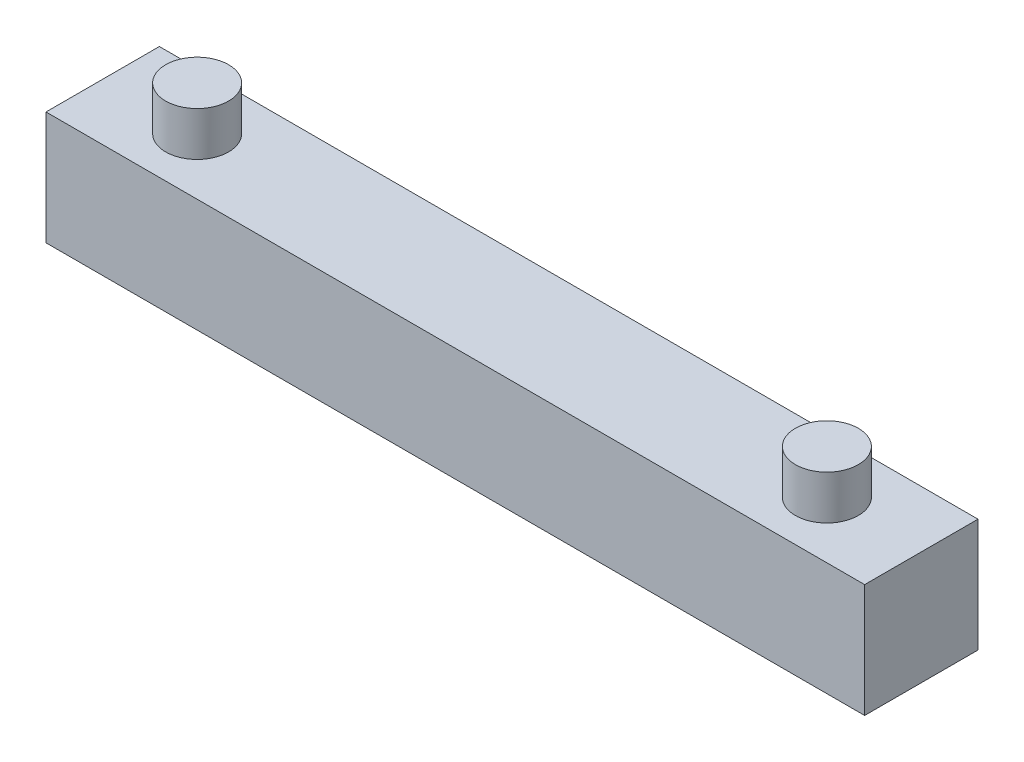
ISO-10303-21;
HEADER;
FILE_DESCRIPTION(('STEP AP214'),'2;1');
FILE_NAME('part.step','',(''),(''),'','','');
FILE_SCHEMA(('AUTOMOTIVE_DESIGN { 1 0 10303 214 1 1 1 1 }'));
ENDSEC;
DATA;
#1=APPLICATION_CONTEXT('core data for automotive mechanical design processes');
#2=APPLICATION_PROTOCOL_DEFINITION('international standard','automotive_design',2000,#1);
#3=PRODUCT_CONTEXT('',#1,'mechanical');
#4=PRODUCT('Part','Part','',(#3));
#5=PRODUCT_RELATED_PRODUCT_CATEGORY('part','',(#4));
#6=PRODUCT_DEFINITION_FORMATION('','',#4);
#7=PRODUCT_DEFINITION_CONTEXT('part definition',#1,'design');
#8=PRODUCT_DEFINITION('design','',#6,#7);
#9=PRODUCT_DEFINITION_SHAPE('','',#8);
#10=(LENGTH_UNIT() NAMED_UNIT(*) SI_UNIT(.MILLI.,.METRE.));
#11=(NAMED_UNIT(*) PLANE_ANGLE_UNIT() SI_UNIT($,.RADIAN.));
#12=(NAMED_UNIT(*) SI_UNIT($,.STERADIAN.) SOLID_ANGLE_UNIT());
#13=UNCERTAINTY_MEASURE_WITH_UNIT(LENGTH_MEASURE(1.E-05),#10,'distance_accuracy_value','');
#14=(GEOMETRIC_REPRESENTATION_CONTEXT(3) GLOBAL_UNCERTAINTY_ASSIGNED_CONTEXT((#13)) GLOBAL_UNIT_ASSIGNED_CONTEXT((#10,
#11,#12)) REPRESENTATION_CONTEXT('',''));
#15=CARTESIAN_POINT('',(0.,0.,0.));
#16=DIRECTION('',(0.,0.,1.));
#17=DIRECTION('',(1.,0.,0.));
#18=AXIS2_PLACEMENT_3D('',#15,#16,#17);
#19=CARTESIAN_POINT('',(0.,0.,9.));
#20=DIRECTION('',(1.,0.,0.));
#21=DIRECTION('',(0.,0.,-1.));
#22=AXIS2_PLACEMENT_3D('',#19,#20,#21);
#23=PLANE('',#22);
#24=DIRECTION('',(0.,-1.,0.));
#25=VECTOR('',#24,1.);
#26=CARTESIAN_POINT('',(0.,0.,0.));
#27=LINE('',#26,#25);
#28=CARTESIAN_POINT('',(0.,9.,0.));
#29=VERTEX_POINT('',#28);
#30=CARTESIAN_POINT('',(0.,0.,0.));
#31=VERTEX_POINT('',#30);
#32=EDGE_CURVE('E100',#29,#31,#27,.T.);
#33=ORIENTED_EDGE('',*,*,#32,.T.);
#34=DIRECTION('',(0.,0.,-1.));
#35=VECTOR('',#34,1.);
#36=CARTESIAN_POINT('',(0.,0.,9.));
#37=LINE('',#36,#35);
#38=CARTESIAN_POINT('',(0.,0.,9.));
#39=VERTEX_POINT('',#38);
#40=EDGE_CURVE('E91',#39,#31,#37,.T.);
#41=ORIENTED_EDGE('',*,*,#40,.F.);
#42=DIRECTION('',(0.,-1.,0.));
#43=VECTOR('',#42,1.);
#44=CARTESIAN_POINT('',(0.,0.,9.));
#45=LINE('',#44,#43);
#46=CARTESIAN_POINT('',(0.,9.,9.));
#47=VERTEX_POINT('',#46);
#48=EDGE_CURVE('E85',#47,#39,#45,.T.);
#49=ORIENTED_EDGE('',*,*,#48,.F.);
#50=DIRECTION('',(0.,0.,-1.));
#51=VECTOR('',#50,1.);
#52=CARTESIAN_POINT('',(0.,9.,9.));
#53=LINE('',#52,#51);
#54=EDGE_CURVE('E96',#47,#29,#53,.T.);
#55=ORIENTED_EDGE('',*,*,#54,.T.);
#56=EDGE_LOOP('',(#33,#41,#49,#55));
#57=FACE_BOUND('',#56,.T.);
#58=ADVANCED_FACE('F33',(#57),#23,.F.);
#59=CARTESIAN_POINT('',(0.,0.,9.));
#60=DIRECTION('',(0.,1.,0.));
#61=DIRECTION('',(0.,0.,1.));
#62=AXIS2_PLACEMENT_3D('',#59,#60,#61);
#63=PLANE('',#62);
#64=DIRECTION('',(1.,0.,0.));
#65=VECTOR('',#64,1.);
#66=CARTESIAN_POINT('',(0.,0.,0.));
#67=LINE('',#66,#65);
#68=CARTESIAN_POINT('',(65.,0.,0.));
#69=VERTEX_POINT('',#68);
#70=EDGE_CURVE('E90',#31,#69,#67,.T.);
#71=ORIENTED_EDGE('',*,*,#70,.T.);
#72=DIRECTION('',(0.,0.,-1.));
#73=VECTOR('',#72,1.);
#74=CARTESIAN_POINT('',(65.,0.,9.));
#75=LINE('',#74,#73);
#76=CARTESIAN_POINT('',(65.,0.,9.));
#77=VERTEX_POINT('',#76);
#78=EDGE_CURVE('E88',#77,#69,#75,.T.);
#79=ORIENTED_EDGE('',*,*,#78,.F.);
#80=DIRECTION('',(1.,0.,0.));
#81=VECTOR('',#80,1.);
#82=CARTESIAN_POINT('',(0.,0.,9.));
#83=LINE('',#82,#81);
#84=EDGE_CURVE('E80',#39,#77,#83,.T.);
#85=ORIENTED_EDGE('',*,*,#84,.F.);
#86=ORIENTED_EDGE('',*,*,#40,.T.);
#87=EDGE_LOOP('',(#71,#79,#85,#86));
#88=FACE_BOUND('',#87,.T.);
#89=ADVANCED_FACE('F89',(#88),#63,.F.);
#90=CARTESIAN_POINT('',(65.,0.,9.));
#91=DIRECTION('',(-1.,0.,0.));
#92=DIRECTION('',(0.,0.,1.));
#93=AXIS2_PLACEMENT_3D('',#90,#91,#92);
#94=PLANE('',#93);
#95=DIRECTION('',(0.,1.,0.));
#96=VECTOR('',#95,1.);
#97=CARTESIAN_POINT('',(65.,0.,0.));
#98=LINE('',#97,#96);
#99=CARTESIAN_POINT('',(65.,9.,0.));
#100=VERTEX_POINT('',#99);
#101=EDGE_CURVE('E66',#69,#100,#98,.T.);
#102=ORIENTED_EDGE('',*,*,#101,.T.);
#103=DIRECTION('',(0.,0.,-1.));
#104=VECTOR('',#103,1.);
#105=CARTESIAN_POINT('',(65.,9.,9.));
#106=LINE('',#105,#104);
#107=CARTESIAN_POINT('',(65.,9.,9.));
#108=VERTEX_POINT('',#107);
#109=EDGE_CURVE('E92',#108,#100,#106,.T.);
#110=ORIENTED_EDGE('',*,*,#109,.F.);
#111=DIRECTION('',(0.,1.,0.));
#112=VECTOR('',#111,1.);
#113=CARTESIAN_POINT('',(65.,0.,9.));
#114=LINE('',#113,#112);
#115=EDGE_CURVE('E83',#77,#108,#114,.T.);
#116=ORIENTED_EDGE('',*,*,#115,.F.);
#117=ORIENTED_EDGE('',*,*,#78,.T.);
#118=EDGE_LOOP('',(#102,#110,#116,#117));
#119=FACE_BOUND('',#118,.T.);
#120=ADVANCED_FACE('F94',(#119),#94,.F.);
#121=CARTESIAN_POINT('',(0.,9.,9.));
#122=DIRECTION('',(0.,-1.,0.));
#123=DIRECTION('',(0.,0.,-1.));
#124=AXIS2_PLACEMENT_3D('',#121,#122,#123);
#125=PLANE('',#124);
#126=CARTESIAN_POINT('',(57.5,9.,4.5));
#127=DIRECTION('',(0.,-1.,0.));
#128=DIRECTION('',(0.,0.,-1.));
#129=AXIS2_PLACEMENT_3D('',#126,#127,#128);
#130=CIRCLE('',#129,2.49999999999999);
#131=CARTESIAN_POINT('',(57.5,9.,2.));
#132=VERTEX_POINT('',#131);
#133=EDGE_CURVE('E11',#132,#132,#130,.F.);
#134=ORIENTED_EDGE('',*,*,#133,.F.);
#135=EDGE_LOOP('',(#134));
#136=FACE_BOUND('',#135,.T.);
#137=CARTESIAN_POINT('',(7.5,9.,4.5));
#138=DIRECTION('',(0.,-1.,0.));
#139=DIRECTION('',(0.,0.,-1.));
#140=AXIS2_PLACEMENT_3D('',#137,#138,#139);
#141=CIRCLE('',#140,2.5);
#142=CARTESIAN_POINT('',(7.5,9.,2.));
#143=VERTEX_POINT('',#142);
#144=EDGE_CURVE('E41',#143,#143,#141,.F.);
#145=ORIENTED_EDGE('',*,*,#144,.F.);
#146=EDGE_LOOP('',(#145));
#147=FACE_BOUND('',#146,.T.);
#148=DIRECTION('',(-1.,0.,0.));
#149=VECTOR('',#148,1.);
#150=CARTESIAN_POINT('',(0.,9.,0.));
#151=LINE('',#150,#149);
#152=EDGE_CURVE('E72',#100,#29,#151,.T.);
#153=ORIENTED_EDGE('',*,*,#152,.T.);
#154=ORIENTED_EDGE('',*,*,#54,.F.);
#155=DIRECTION('',(-1.,0.,0.));
#156=VECTOR('',#155,1.);
#157=CARTESIAN_POINT('',(0.,9.,9.));
#158=LINE('',#157,#156);
#159=EDGE_CURVE('E49',#108,#47,#158,.T.);
#160=ORIENTED_EDGE('',*,*,#159,.F.);
#161=ORIENTED_EDGE('',*,*,#109,.T.);
#162=EDGE_LOOP('',(#153,#154,#160,#161));
#163=FACE_BOUND('',#162,.T.);
#164=ADVANCED_FACE('F114',(#136,#147,#163),#125,.F.);
#165=CARTESIAN_POINT('',(0.,0.,9.));
#166=DIRECTION('',(0.,0.,-1.));
#167=DIRECTION('',(-1.,0.,0.));
#168=AXIS2_PLACEMENT_3D('',#165,#166,#167);
#169=PLANE('',#168);
#170=ORIENTED_EDGE('',*,*,#48,.T.);
#171=ORIENTED_EDGE('',*,*,#84,.T.);
#172=ORIENTED_EDGE('',*,*,#115,.T.);
#173=ORIENTED_EDGE('',*,*,#159,.T.);
#174=EDGE_LOOP('',(#170,#171,#172,#173));
#175=FACE_BOUND('',#174,.T.);
#176=ADVANCED_FACE('F81',(#175),#169,.F.);
#177=CARTESIAN_POINT('',(0.,0.,0.));
#178=DIRECTION('',(0.,0.,-1.));
#179=DIRECTION('',(-1.,0.,0.));
#180=AXIS2_PLACEMENT_3D('',#177,#178,#179);
#181=PLANE('',#180);
#182=ORIENTED_EDGE('',*,*,#32,.F.);
#183=ORIENTED_EDGE('',*,*,#152,.F.);
#184=ORIENTED_EDGE('',*,*,#101,.F.);
#185=ORIENTED_EDGE('',*,*,#70,.F.);
#186=EDGE_LOOP('',(#182,#183,#184,#185));
#187=FACE_BOUND('',#186,.T.);
#188=ADVANCED_FACE('F122',(#187),#181,.T.);
#189=CARTESIAN_POINT('',(7.5,12.5,4.5));
#190=DIRECTION('',(0.,-1.,0.));
#191=DIRECTION('',(0.,0.,-1.));
#192=AXIS2_PLACEMENT_3D('',#189,#190,#191);
#193=CYLINDRICAL_SURFACE('',#192,2.5);
#194=CARTESIAN_POINT('',(7.5,12.5,4.5));
#195=DIRECTION('',(0.,1.,0.));
#196=DIRECTION('',(0.,0.,1.));
#197=AXIS2_PLACEMENT_3D('',#194,#195,#196);
#198=CIRCLE('',#197,2.5);
#199=CARTESIAN_POINT('',(7.5,12.5,7.));
#200=VERTEX_POINT('',#199);
#201=EDGE_CURVE('E103',#200,#200,#198,.T.);
#202=ORIENTED_EDGE('',*,*,#201,.F.);
#203=EDGE_LOOP('',(#202));
#204=FACE_BOUND('',#203,.T.);
#205=ORIENTED_EDGE('',*,*,#144,.T.);
#206=EDGE_LOOP('',(#205));
#207=FACE_BOUND('',#206,.T.);
#208=ADVANCED_FACE('F112',(#204,#207),#193,.T.);
#209=CARTESIAN_POINT('',(7.5,12.5,4.5));
#210=DIRECTION('',(0.,1.,0.));
#211=DIRECTION('',(0.,0.,1.));
#212=AXIS2_PLACEMENT_3D('',#209,#210,#211);
#213=PLANE('',#212);
#214=ORIENTED_EDGE('',*,*,#201,.T.);
#215=EDGE_LOOP('',(#214));
#216=FACE_BOUND('',#215,.T.);
#217=ADVANCED_FACE('F138',(#216),#213,.T.);
#218=CARTESIAN_POINT('',(57.5,12.5,4.5));
#219=DIRECTION('',(0.,-1.,0.));
#220=DIRECTION('',(0.,0.,-1.));
#221=AXIS2_PLACEMENT_3D('',#218,#219,#220);
#222=CYLINDRICAL_SURFACE('',#221,2.49999999999999);
#223=CARTESIAN_POINT('',(57.5,12.5,4.5));
#224=DIRECTION('',(0.,1.,0.));
#225=DIRECTION('',(0.,0.,1.));
#226=AXIS2_PLACEMENT_3D('',#223,#224,#225);
#227=CIRCLE('',#226,2.49999999999999);
#228=CARTESIAN_POINT('',(57.5,12.5,6.99999999999999));
#229=VERTEX_POINT('',#228);
#230=EDGE_CURVE('E156',#229,#229,#227,.T.);
#231=ORIENTED_EDGE('',*,*,#230,.F.);
#232=EDGE_LOOP('',(#231));
#233=FACE_BOUND('',#232,.T.);
#234=ORIENTED_EDGE('',*,*,#133,.T.);
#235=EDGE_LOOP('',(#234));
#236=FACE_BOUND('',#235,.T.);
#237=ADVANCED_FACE('F144',(#233,#236),#222,.T.);
#238=CARTESIAN_POINT('',(57.5,12.5,4.5));
#239=DIRECTION('',(0.,1.,0.));
#240=DIRECTION('',(0.,0.,1.));
#241=AXIS2_PLACEMENT_3D('',#238,#239,#240);
#242=PLANE('',#241);
#243=ORIENTED_EDGE('',*,*,#230,.T.);
#244=EDGE_LOOP('',(#243));
#245=FACE_BOUND('',#244,.T.);
#246=ADVANCED_FACE('F148',(#245),#242,.T.);
#247=CLOSED_SHELL('',(#58,#89,#120,#164,#176,#188,#208,#217,#237,#246));
#248=MANIFOLD_SOLID_BREP('B2',#247);
#249=ADVANCED_BREP_SHAPE_REPRESENTATION('',(#18,#248),#14);
#250=SHAPE_DEFINITION_REPRESENTATION(#9,#249);
ENDSEC;
END-ISO-10303-21;
